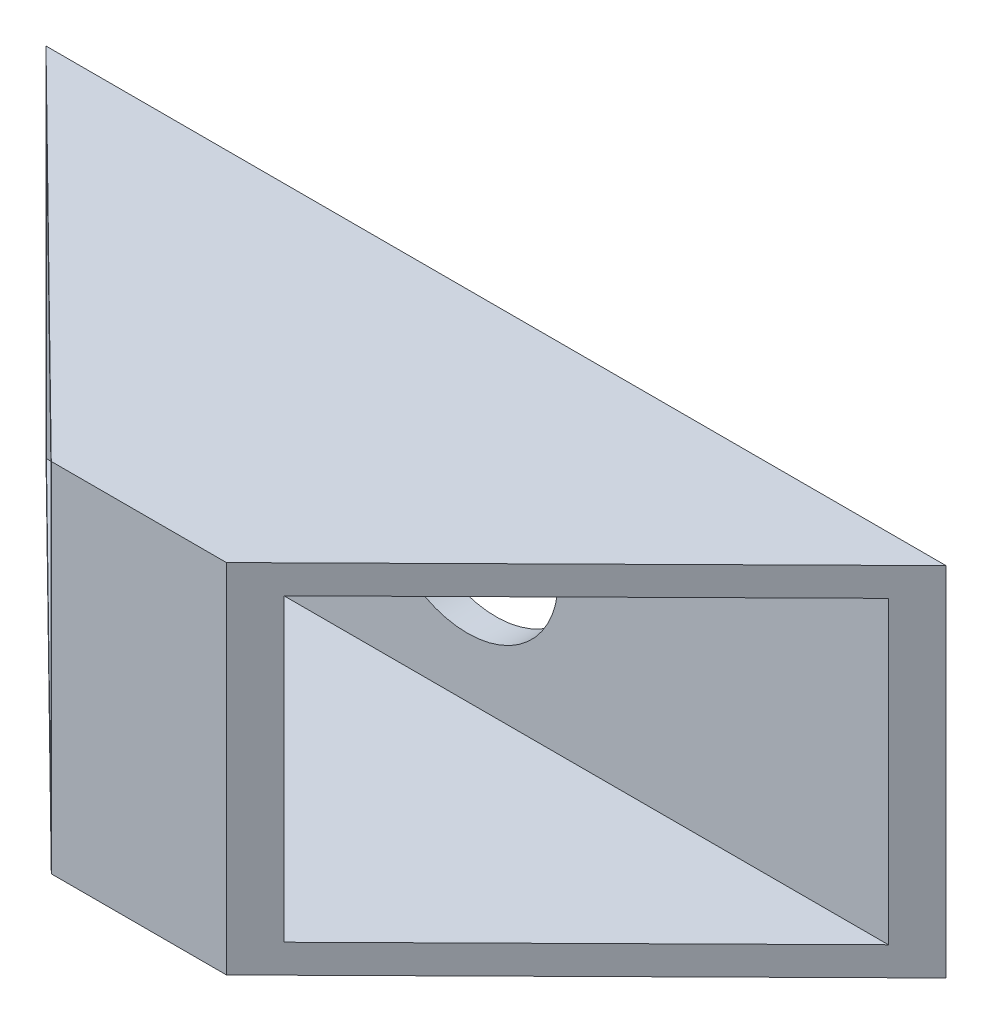
ISO-10303-21;
HEADER;
FILE_DESCRIPTION(('STEP AP214'),'2;1');
FILE_NAME('part.step','',(''),(''),'','','');
FILE_SCHEMA(('AUTOMOTIVE_DESIGN { 1 0 10303 214 1 1 1 1 }'));
ENDSEC;
DATA;
#1=APPLICATION_CONTEXT('core data for automotive mechanical design processes');
#2=APPLICATION_PROTOCOL_DEFINITION('international standard','automotive_design',2000,#1);
#3=PRODUCT_CONTEXT('',#1,'mechanical');
#4=PRODUCT('Part','Part','',(#3));
#5=PRODUCT_RELATED_PRODUCT_CATEGORY('part','',(#4));
#6=PRODUCT_DEFINITION_FORMATION('','',#4);
#7=PRODUCT_DEFINITION_CONTEXT('part definition',#1,'design');
#8=PRODUCT_DEFINITION('design','',#6,#7);
#9=PRODUCT_DEFINITION_SHAPE('','',#8);
#10=(LENGTH_UNIT() NAMED_UNIT(*) SI_UNIT(.MILLI.,.METRE.));
#11=(NAMED_UNIT(*) PLANE_ANGLE_UNIT() SI_UNIT($,.RADIAN.));
#12=(NAMED_UNIT(*) SI_UNIT($,.STERADIAN.) SOLID_ANGLE_UNIT());
#13=UNCERTAINTY_MEASURE_WITH_UNIT(LENGTH_MEASURE(1.E-05),#10,'distance_accuracy_value','');
#14=(GEOMETRIC_REPRESENTATION_CONTEXT(3) GLOBAL_UNCERTAINTY_ASSIGNED_CONTEXT((#13)) GLOBAL_UNIT_ASSIGNED_CONTEXT((#10,
#11,#12)) REPRESENTATION_CONTEXT('',''));
#15=CARTESIAN_POINT('',(0.,0.,0.));
#16=DIRECTION('',(0.,0.,1.));
#17=DIRECTION('',(1.,0.,0.));
#18=AXIS2_PLACEMENT_3D('',#15,#16,#17);
#19=CARTESIAN_POINT('',(-17.3503166226913,25.,-15.957783641161));
#20=DIRECTION('',(0.701893691445356,0.,-0.712281718078747));
#21=DIRECTION('',(-0.712281718078747,0.,-0.701893691445356));
#22=AXIS2_PLACEMENT_3D('',#19,#20,#21);
#23=PLANE('',#22);
#24=DIRECTION('',(0.712281718078747,0.,0.701893691445356));
#25=VECTOR('',#24,1.);
#26=CARTESIAN_POINT('',(-17.3503166226913,0.,-15.957783641161));
#27=LINE('',#26,#25);
#28=CARTESIAN_POINT('',(-17.3503166226913,0.,-15.957783641161));
#29=VERTEX_POINT('',#28);
#30=CARTESIAN_POINT('',(8.01968337730869,0.,9.04221635883905));
#31=VERTEX_POINT('',#30);
#32=EDGE_CURVE('E128',#29,#31,#27,.T.);
#33=ORIENTED_EDGE('',*,*,#32,.T.);
#34=DIRECTION('',(0.,-1.,0.));
#35=VECTOR('',#34,1.);
#36=CARTESIAN_POINT('',(8.01968337730869,25.,9.04221635883905));
#37=LINE('',#36,#35);
#38=CARTESIAN_POINT('',(8.01968337730869,25.,9.04221635883905));
#39=VERTEX_POINT('',#38);
#40=EDGE_CURVE('E11',#39,#31,#37,.T.);
#41=ORIENTED_EDGE('',*,*,#40,.F.);
#42=DIRECTION('',(0.712281718078747,0.,0.701893691445356));
#43=VECTOR('',#42,1.);
#44=CARTESIAN_POINT('',(-17.3503166226913,25.,-15.957783641161));
#45=LINE('',#44,#43);
#46=CARTESIAN_POINT('',(-17.3503166226913,25.,-15.957783641161));
#47=VERTEX_POINT('',#46);
#48=EDGE_CURVE('E133',#47,#39,#45,.T.);
#49=ORIENTED_EDGE('',*,*,#48,.F.);
#50=DIRECTION('',(0.,-1.,0.));
#51=VECTOR('',#50,1.);
#52=CARTESIAN_POINT('',(-17.3503166226913,25.,-15.957783641161));
#53=LINE('',#52,#51);
#54=EDGE_CURVE('E143',#47,#29,#53,.T.);
#55=ORIENTED_EDGE('',*,*,#54,.T.);
#56=EDGE_LOOP('',(#33,#41,#49,#55));
#57=FACE_BOUND('',#56,.T.);
#58=DIRECTION('',(0.712281718078747,0.,0.701893691445356));
#59=VECTOR('',#58,1.);
#60=CARTESIAN_POINT('',(-0.56968515954071,2.,0.578116499901913));
#61=LINE('',#60,#59);
#62=CARTESIAN_POINT('',(-15.3207166226913,2.,-13.957783641161));
#63=VERTEX_POINT('',#62);
#64=CARTESIAN_POINT('',(5.99008337730869,2.,7.04221635883905));
#65=VERTEX_POINT('',#64);
#66=EDGE_CURVE('E104',#63,#65,#61,.T.);
#67=ORIENTED_EDGE('',*,*,#66,.F.);
#68=DIRECTION('',(0.,-1.,0.));
#69=VECTOR('',#68,1.);
#70=CARTESIAN_POINT('',(-15.3207166226913,25.,-13.957783641161));
#71=LINE('',#70,#69);
#72=CARTESIAN_POINT('',(-15.3207166226913,23.,-13.957783641161));
#73=VERTEX_POINT('',#72);
#74=EDGE_CURVE('E124',#73,#63,#71,.T.);
#75=ORIENTED_EDGE('',*,*,#74,.F.);
#76=DIRECTION('',(0.712281718078747,0.,0.701893691445356));
#77=VECTOR('',#76,1.);
#78=CARTESIAN_POINT('',(-0.56968515954071,23.,0.578116499901913));
#79=LINE('',#78,#77);
#80=CARTESIAN_POINT('',(5.99008337730869,23.,7.04221635883905));
#81=VERTEX_POINT('',#80);
#82=EDGE_CURVE('E48',#73,#81,#79,.T.);
#83=ORIENTED_EDGE('',*,*,#82,.T.);
#84=DIRECTION('',(0.,-1.,0.));
#85=VECTOR('',#84,1.);
#86=CARTESIAN_POINT('',(5.99008337730869,25.,7.04221635883905));
#87=LINE('',#86,#85);
#88=EDGE_CURVE('E114',#81,#65,#87,.T.);
#89=ORIENTED_EDGE('',*,*,#88,.T.);
#90=EDGE_LOOP('',(#67,#75,#83,#89));
#91=FACE_BOUND('',#90,.T.);
#92=ADVANCED_FACE('F33',(#57,#91),#23,.F.);
#93=CARTESIAN_POINT('',(45.6496833773087,25.,-15.957783641161));
#94=DIRECTION('',(-0.701893691445356,0.,-0.712281718078747));
#95=DIRECTION('',(-0.712281718078747,0.,0.701893691445356));
#96=AXIS2_PLACEMENT_3D('',#93,#94,#95);
#97=PLANE('',#96);
#98=DIRECTION('',(0.712281718078747,0.,-0.701893691445356));
#99=VECTOR('',#98,1.);
#100=CARTESIAN_POINT('',(45.6496833773087,0.,-15.957783641161));
#101=LINE('',#100,#99);
#102=CARTESIAN_POINT('',(20.2796833773087,0.,9.04221635883905));
#103=VERTEX_POINT('',#102);
#104=CARTESIAN_POINT('',(45.6496833773087,0.,-15.957783641161));
#105=VERTEX_POINT('',#104);
#106=EDGE_CURVE('E148',#103,#105,#101,.T.);
#107=ORIENTED_EDGE('',*,*,#106,.T.);
#108=DIRECTION('',(0.,-1.,0.));
#109=VECTOR('',#108,1.);
#110=CARTESIAN_POINT('',(45.6496833773087,25.,-15.957783641161));
#111=LINE('',#110,#109);
#112=CARTESIAN_POINT('',(45.6496833773087,25.,-15.957783641161));
#113=VERTEX_POINT('',#112);
#114=EDGE_CURVE('E153',#113,#105,#111,.T.);
#115=ORIENTED_EDGE('',*,*,#114,.F.);
#116=DIRECTION('',(0.712281718078747,0.,-0.701893691445356));
#117=VECTOR('',#116,1.);
#118=CARTESIAN_POINT('',(45.6496833773087,25.,-15.957783641161));
#119=LINE('',#118,#117);
#120=CARTESIAN_POINT('',(20.2796833773087,25.,9.04221635883905));
#121=VERTEX_POINT('',#120);
#122=EDGE_CURVE('E139',#121,#113,#119,.T.);
#123=ORIENTED_EDGE('',*,*,#122,.F.);
#124=DIRECTION('',(0.,-1.,0.));
#125=VECTOR('',#124,1.);
#126=CARTESIAN_POINT('',(20.2796833773087,25.,9.04221635883905));
#127=LINE('',#126,#125);
#128=EDGE_CURVE('E41',#121,#103,#127,.T.);
#129=ORIENTED_EDGE('',*,*,#128,.T.);
#130=EDGE_LOOP('',(#107,#115,#123,#129));
#131=FACE_BOUND('',#130,.T.);
#132=DIRECTION('',(0.712281718078747,0.,-0.701893691445356));
#133=VECTOR('',#132,1.);
#134=CARTESIAN_POINT('',(14.5115027289618,2.,14.7262729693504));
#135=LINE('',#134,#133);
#136=CARTESIAN_POINT('',(22.3092833773087,2.,7.04221635883905));
#137=VERTEX_POINT('',#136);
#138=CARTESIAN_POINT('',(43.6200833773087,2.,-13.957783641161));
#139=VERTEX_POINT('',#138);
#140=EDGE_CURVE('E101',#137,#139,#135,.T.);
#141=ORIENTED_EDGE('',*,*,#140,.F.);
#142=DIRECTION('',(0.,-1.,0.));
#143=VECTOR('',#142,1.);
#144=CARTESIAN_POINT('',(22.3092833773087,25.,7.04221635883905));
#145=LINE('',#144,#143);
#146=CARTESIAN_POINT('',(22.3092833773087,23.,7.04221635883905));
#147=VERTEX_POINT('',#146);
#148=EDGE_CURVE('E110',#147,#137,#145,.T.);
#149=ORIENTED_EDGE('',*,*,#148,.F.);
#150=DIRECTION('',(0.712281718078747,0.,-0.701893691445356));
#151=VECTOR('',#150,1.);
#152=CARTESIAN_POINT('',(14.5115027289618,23.,14.7262729693504));
#153=LINE('',#152,#151);
#154=CARTESIAN_POINT('',(43.6200833773087,23.,-13.957783641161));
#155=VERTEX_POINT('',#154);
#156=EDGE_CURVE('E53',#147,#155,#153,.T.);
#157=ORIENTED_EDGE('',*,*,#156,.T.);
#158=DIRECTION('',(0.,-1.,0.));
#159=VECTOR('',#158,1.);
#160=CARTESIAN_POINT('',(43.6200833773087,25.,-13.957783641161));
#161=LINE('',#160,#159);
#162=EDGE_CURVE('E115',#155,#139,#161,.T.);
#163=ORIENTED_EDGE('',*,*,#162,.T.);
#164=EDGE_LOOP('',(#141,#149,#157,#163));
#165=FACE_BOUND('',#164,.T.);
#166=ADVANCED_FACE('F118',(#131,#165),#97,.F.);
#167=CARTESIAN_POINT('',(8.01968337730869,25.,9.04221635883905));
#168=DIRECTION('',(0.,0.,-1.));
#169=DIRECTION('',(-1.,0.,0.));
#170=AXIS2_PLACEMENT_3D('',#167,#168,#169);
#171=PLANE('',#170);
#172=DIRECTION('',(1.,0.,0.));
#173=VECTOR('',#172,1.);
#174=CARTESIAN_POINT('',(8.01968337730869,0.,9.04221635883905));
#175=LINE('',#174,#173);
#176=EDGE_CURVE('E146',#31,#103,#175,.T.);
#177=ORIENTED_EDGE('',*,*,#176,.T.);
#178=ORIENTED_EDGE('',*,*,#128,.F.);
#179=DIRECTION('',(1.,0.,0.));
#180=VECTOR('',#179,1.);
#181=CARTESIAN_POINT('',(8.01968337730869,25.,9.04221635883905));
#182=LINE('',#181,#180);
#183=EDGE_CURVE('E136',#39,#121,#182,.T.);
#184=ORIENTED_EDGE('',*,*,#183,.F.);
#185=ORIENTED_EDGE('',*,*,#40,.T.);
#186=EDGE_LOOP('',(#177,#178,#184,#185));
#187=FACE_BOUND('',#186,.T.);
#188=ADVANCED_FACE('F177',(#187),#171,.F.);
#189=CARTESIAN_POINT('',(-17.3503166226913,25.,-15.957783641161));
#190=DIRECTION('',(0.,0.,1.));
#191=DIRECTION('',(1.,0.,0.));
#192=AXIS2_PLACEMENT_3D('',#189,#190,#191);
#193=PLANE('',#192);
#194=CARTESIAN_POINT('',(14.1496833773087,12.5,-15.957783641161));
#195=DIRECTION('',(0.,0.,-1.));
#196=DIRECTION('',(-1.,0.,0.));
#197=AXIS2_PLACEMENT_3D('',#194,#195,#196);
#198=CIRCLE('',#197,6.35);
#199=CARTESIAN_POINT('',(7.79968337730869,12.5,-15.957783641161));
#200=VERTEX_POINT('',#199);
#201=EDGE_CURVE('E273',#200,#200,#198,.T.);
#202=ORIENTED_EDGE('',*,*,#201,.F.);
#203=EDGE_LOOP('',(#202));
#204=FACE_BOUND('',#203,.T.);
#205=DIRECTION('',(-1.,0.,0.));
#206=VECTOR('',#205,1.);
#207=CARTESIAN_POINT('',(-17.3503166226913,0.,-15.957783641161));
#208=LINE('',#207,#206);
#209=EDGE_CURVE('E137',#105,#29,#208,.T.);
#210=ORIENTED_EDGE('',*,*,#209,.T.);
#211=ORIENTED_EDGE('',*,*,#54,.F.);
#212=DIRECTION('',(-1.,0.,0.));
#213=VECTOR('',#212,1.);
#214=CARTESIAN_POINT('',(-17.3503166226913,25.,-15.957783641161));
#215=LINE('',#214,#213);
#216=EDGE_CURVE('E141',#113,#47,#215,.T.);
#217=ORIENTED_EDGE('',*,*,#216,.F.);
#218=ORIENTED_EDGE('',*,*,#114,.T.);
#219=EDGE_LOOP('',(#210,#211,#217,#218));
#220=FACE_BOUND('',#219,.T.);
#221=ADVANCED_FACE('F169',(#204,#220),#193,.F.);
#222=CARTESIAN_POINT('',(0.,25.,0.));
#223=DIRECTION('',(0.,-1.,0.));
#224=DIRECTION('',(0.,0.,-1.));
#225=AXIS2_PLACEMENT_3D('',#222,#223,#224);
#226=PLANE('',#225);
#227=ORIENTED_EDGE('',*,*,#48,.T.);
#228=ORIENTED_EDGE('',*,*,#183,.T.);
#229=ORIENTED_EDGE('',*,*,#122,.T.);
#230=ORIENTED_EDGE('',*,*,#216,.T.);
#231=EDGE_LOOP('',(#227,#228,#229,#230));
#232=FACE_BOUND('',#231,.T.);
#233=ADVANCED_FACE('F176',(#232),#226,.F.);
#234=CARTESIAN_POINT('',(0.,0.,0.));
#235=DIRECTION('',(0.,-1.,0.));
#236=DIRECTION('',(0.,0.,-1.));
#237=AXIS2_PLACEMENT_3D('',#234,#235,#236);
#238=PLANE('',#237);
#239=ORIENTED_EDGE('',*,*,#32,.F.);
#240=ORIENTED_EDGE('',*,*,#209,.F.);
#241=ORIENTED_EDGE('',*,*,#106,.F.);
#242=ORIENTED_EDGE('',*,*,#176,.F.);
#243=EDGE_LOOP('',(#239,#240,#241,#242));
#244=FACE_BOUND('',#243,.T.);
#245=ADVANCED_FACE('F166',(#244),#238,.T.);
#246=CARTESIAN_POINT('',(8.01968337730869,25.,7.04221635883905));
#247=DIRECTION('',(0.,0.,-1.));
#248=DIRECTION('',(-1.,0.,0.));
#249=AXIS2_PLACEMENT_3D('',#246,#247,#248);
#250=PLANE('',#249);
#251=DIRECTION('',(1.,0.,0.));
#252=VECTOR('',#251,1.);
#253=CARTESIAN_POINT('',(0.,2.,7.04221635883905));
#254=LINE('',#253,#252);
#255=EDGE_CURVE('E97',#65,#137,#254,.T.);
#256=ORIENTED_EDGE('',*,*,#255,.F.);
#257=ORIENTED_EDGE('',*,*,#88,.F.);
#258=DIRECTION('',(1.,0.,0.));
#259=VECTOR('',#258,1.);
#260=CARTESIAN_POINT('',(0.,23.,7.04221635883905));
#261=LINE('',#260,#259);
#262=EDGE_CURVE('E112',#81,#147,#261,.T.);
#263=ORIENTED_EDGE('',*,*,#262,.T.);
#264=ORIENTED_EDGE('',*,*,#148,.T.);
#265=EDGE_LOOP('',(#256,#257,#263,#264));
#266=FACE_BOUND('',#265,.T.);
#267=ADVANCED_FACE('F111',(#266),#250,.T.);
#268=CARTESIAN_POINT('',(-17.3503166226913,25.,-13.957783641161));
#269=DIRECTION('',(0.,0.,1.));
#270=DIRECTION('',(1.,0.,0.));
#271=AXIS2_PLACEMENT_3D('',#268,#269,#270);
#272=PLANE('',#271);
#273=CARTESIAN_POINT('',(14.1496833773087,12.5,-13.957783641161));
#274=DIRECTION('',(0.,0.,1.));
#275=DIRECTION('',(1.,0.,0.));
#276=AXIS2_PLACEMENT_3D('',#273,#274,#275);
#277=CIRCLE('',#276,6.35);
#278=CARTESIAN_POINT('',(20.4996833773087,12.5,-13.957783641161));
#279=VERTEX_POINT('',#278);
#280=EDGE_CURVE('E36',#279,#279,#277,.T.);
#281=ORIENTED_EDGE('',*,*,#280,.F.);
#282=EDGE_LOOP('',(#281));
#283=FACE_BOUND('',#282,.T.);
#284=DIRECTION('',(-1.,0.,0.));
#285=VECTOR('',#284,1.);
#286=CARTESIAN_POINT('',(0.,2.,-13.957783641161));
#287=LINE('',#286,#285);
#288=EDGE_CURVE('E119',#139,#63,#287,.T.);
#289=ORIENTED_EDGE('',*,*,#288,.F.);
#290=ORIENTED_EDGE('',*,*,#162,.F.);
#291=DIRECTION('',(-1.,0.,0.));
#292=VECTOR('',#291,1.);
#293=CARTESIAN_POINT('',(0.,23.,-13.957783641161));
#294=LINE('',#293,#292);
#295=EDGE_CURVE('E126',#155,#73,#294,.T.);
#296=ORIENTED_EDGE('',*,*,#295,.T.);
#297=ORIENTED_EDGE('',*,*,#74,.T.);
#298=EDGE_LOOP('',(#289,#290,#296,#297));
#299=FACE_BOUND('',#298,.T.);
#300=ADVANCED_FACE('F204',(#283,#299),#272,.T.);
#301=CARTESIAN_POINT('',(0.,23.,0.));
#302=DIRECTION('',(0.,-1.,0.));
#303=DIRECTION('',(0.,0.,-1.));
#304=AXIS2_PLACEMENT_3D('',#301,#302,#303);
#305=PLANE('',#304);
#306=ORIENTED_EDGE('',*,*,#82,.F.);
#307=ORIENTED_EDGE('',*,*,#295,.F.);
#308=ORIENTED_EDGE('',*,*,#156,.F.);
#309=ORIENTED_EDGE('',*,*,#262,.F.);
#310=EDGE_LOOP('',(#306,#307,#308,#309));
#311=FACE_BOUND('',#310,.T.);
#312=ADVANCED_FACE('F212',(#311),#305,.T.);
#313=CARTESIAN_POINT('',(0.,2.,0.));
#314=DIRECTION('',(0.,-1.,0.));
#315=DIRECTION('',(0.,0.,-1.));
#316=AXIS2_PLACEMENT_3D('',#313,#314,#315);
#317=PLANE('',#316);
#318=ORIENTED_EDGE('',*,*,#66,.T.);
#319=ORIENTED_EDGE('',*,*,#255,.T.);
#320=ORIENTED_EDGE('',*,*,#140,.T.);
#321=ORIENTED_EDGE('',*,*,#288,.T.);
#322=EDGE_LOOP('',(#318,#319,#320,#321));
#323=FACE_BOUND('',#322,.T.);
#324=ADVANCED_FACE('F99',(#323),#317,.F.);
#325=CARTESIAN_POINT('',(14.1496833773087,12.5,-5.95778364116095));
#326=DIRECTION('',(0.,0.,-1.));
#327=DIRECTION('',(-1.,0.,0.));
#328=AXIS2_PLACEMENT_3D('',#325,#326,#327);
#329=CYLINDRICAL_SURFACE('',#328,6.35);
#330=ORIENTED_EDGE('',*,*,#280,.T.);
#331=EDGE_LOOP('',(#330));
#332=FACE_BOUND('',#331,.T.);
#333=ORIENTED_EDGE('',*,*,#201,.T.);
#334=EDGE_LOOP('',(#333));
#335=FACE_BOUND('',#334,.T.);
#336=ADVANCED_FACE('F225',(#332,#335),#329,.F.);
#337=CLOSED_SHELL('',(#92,#166,#188,#221,#233,#245,#267,#300,#312,#324,#336));
#338=MANIFOLD_SOLID_BREP('B2',#337);
#339=ADVANCED_BREP_SHAPE_REPRESENTATION('',(#18,#338),#14);
#340=SHAPE_DEFINITION_REPRESENTATION(#9,#339);
ENDSEC;
END-ISO-10303-21;
